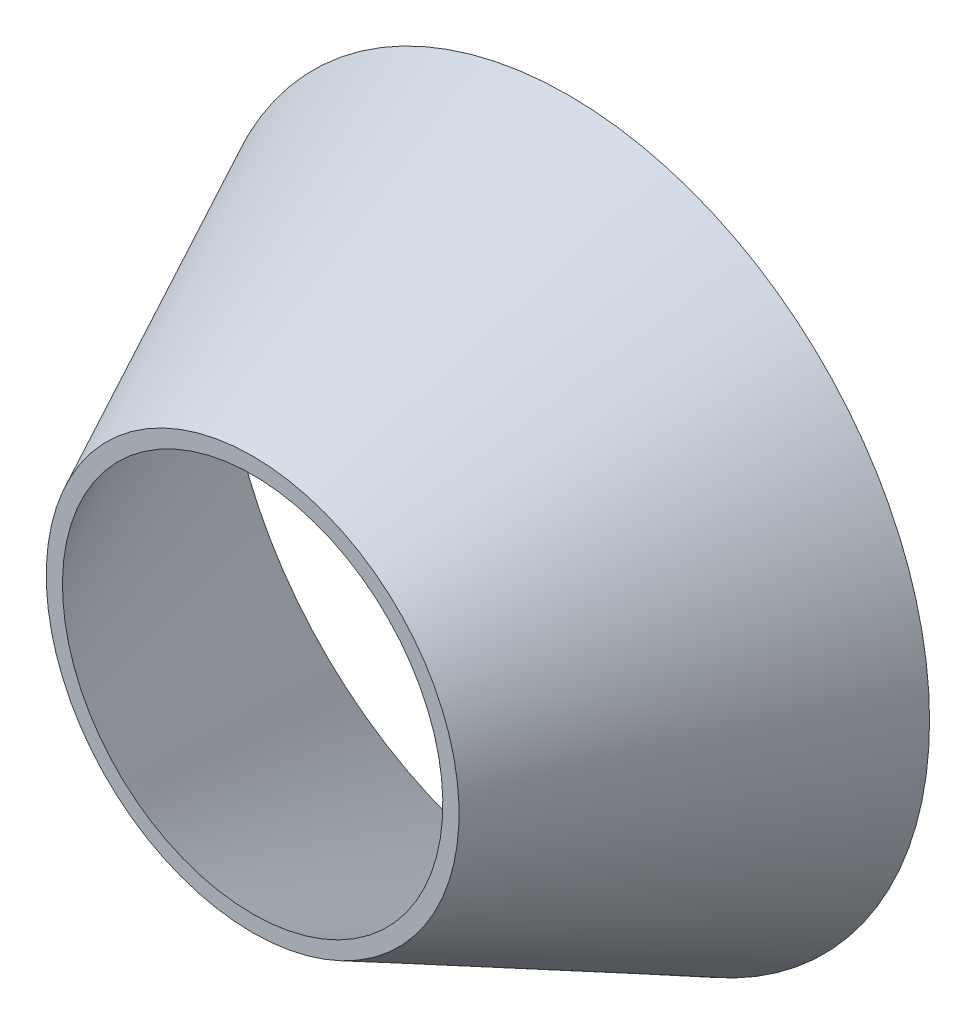
ISO-10303-21;
HEADER;
FILE_DESCRIPTION(('STEP AP214'),'2;1');
FILE_NAME('part.step','',(''),(''),'','','');
FILE_SCHEMA(('AUTOMOTIVE_DESIGN { 1 0 10303 214 1 1 1 1 }'));
ENDSEC;
DATA;
#1=APPLICATION_CONTEXT('core data for automotive mechanical design processes');
#2=APPLICATION_PROTOCOL_DEFINITION('international standard','automotive_design',2000,#1);
#3=PRODUCT_CONTEXT('',#1,'mechanical');
#4=PRODUCT('Part','Part','',(#3));
#5=PRODUCT_RELATED_PRODUCT_CATEGORY('part','',(#4));
#6=PRODUCT_DEFINITION_FORMATION('','',#4);
#7=PRODUCT_DEFINITION_CONTEXT('part definition',#1,'design');
#8=PRODUCT_DEFINITION('design','',#6,#7);
#9=PRODUCT_DEFINITION_SHAPE('','',#8);
#10=(LENGTH_UNIT() NAMED_UNIT(*) SI_UNIT(.MILLI.,.METRE.));
#11=(NAMED_UNIT(*) PLANE_ANGLE_UNIT() SI_UNIT($,.RADIAN.));
#12=(NAMED_UNIT(*) SI_UNIT($,.STERADIAN.) SOLID_ANGLE_UNIT());
#13=UNCERTAINTY_MEASURE_WITH_UNIT(LENGTH_MEASURE(1.E-05),#10,'distance_accuracy_value','');
#14=(GEOMETRIC_REPRESENTATION_CONTEXT(3) GLOBAL_UNCERTAINTY_ASSIGNED_CONTEXT((#13)) GLOBAL_UNIT_ASSIGNED_CONTEXT((#10,
#11,#12)) REPRESENTATION_CONTEXT('',''));
#15=CARTESIAN_POINT('',(0.,0.,0.));
#16=DIRECTION('',(0.,0.,1.));
#17=DIRECTION('',(1.,0.,0.));
#18=AXIS2_PLACEMENT_3D('',#15,#16,#17);
#19=CARTESIAN_POINT('',(0.,0.,-1892.51708064606));
#20=DIRECTION('',(0.,0.,-1.));
#21=DIRECTION('',(0.,1.,0.));
#22=AXIS2_PLACEMENT_3D('',#19,#20,#21);
#23=CONICAL_SURFACE('',#22,283.47969619,0.455091851568405);
#24=CARTESIAN_POINT('',(0.,0.,-2326.38914095866));
#25=DIRECTION('',(0.,0.,1.));
#26=DIRECTION('',(0.,-1.,0.));
#27=AXIS2_PLACEMENT_3D('',#24,#25,#26);
#28=CIRCLE('',#27,495.795249314038);
#29=CARTESIAN_POINT('',(0.,-495.795249314038,-2326.38914095866));
#30=VERTEX_POINT('',#29);
#31=EDGE_CURVE('E50',#30,#30,#28,.T.);
#32=ORIENTED_EDGE('',*,*,#31,.T.);
#33=EDGE_LOOP('',(#32));
#34=FACE_BOUND('',#33,.T.);
#35=CARTESIAN_POINT('',(0.,0.,-1892.51708064606));
#36=DIRECTION('',(0.,0.,1.));
#37=DIRECTION('',(0.,-1.,0.));
#38=AXIS2_PLACEMENT_3D('',#35,#36,#37);
#39=CIRCLE('',#38,283.47969619);
#40=CARTESIAN_POINT('',(0.,-283.47969619,-1892.51708064606));
#41=VERTEX_POINT('',#40);
#42=EDGE_CURVE('E10',#41,#41,#39,.T.);
#43=ORIENTED_EDGE('',*,*,#42,.F.);
#44=EDGE_LOOP('',(#43));
#45=FACE_BOUND('',#44,.T.);
#46=ADVANCED_FACE('F36',(#34,#45),#23,.T.);
#47=CARTESIAN_POINT('',(0.,0.,-1892.51708064606));
#48=DIRECTION('',(0.,0.,-1.));
#49=DIRECTION('',(0.,1.,0.));
#50=AXIS2_PLACEMENT_3D('',#47,#48,#49);
#51=PLANE('',#50);
#52=CARTESIAN_POINT('',(0.,0.,-1892.51708064606));
#53=DIRECTION('',(0.,0.,1.));
#54=DIRECTION('',(0.,-1.,0.));
#55=AXIS2_PLACEMENT_3D('',#52,#53,#54);
#56=CIRCLE('',#55,261.213452591977);
#57=CARTESIAN_POINT('',(0.,-261.213452591977,-1892.51708064606));
#58=VERTEX_POINT('',#57);
#59=EDGE_CURVE('E42',#58,#58,#56,.T.);
#60=ORIENTED_EDGE('',*,*,#59,.F.);
#61=EDGE_LOOP('',(#60));
#62=FACE_BOUND('',#61,.T.);
#63=ORIENTED_EDGE('',*,*,#42,.T.);
#64=EDGE_LOOP('',(#63));
#65=FACE_BOUND('',#64,.T.);
#66=ADVANCED_FACE('F66',(#62,#65),#51,.F.);
#67=CARTESIAN_POINT('',(0.,0.,-1892.51708064606));
#68=DIRECTION('',(0.,0.,-1.));
#69=DIRECTION('',(0.,1.,0.));
#70=AXIS2_PLACEMENT_3D('',#67,#68,#69);
#71=CONICAL_SURFACE('',#70,261.213452591977,0.455091851568406);
#72=CARTESIAN_POINT('',(0.,0.,-2326.38914095866));
#73=DIRECTION('',(0.,0.,1.));
#74=DIRECTION('',(0.,-1.,0.));
#75=AXIS2_PLACEMENT_3D('',#72,#73,#74);
#76=CIRCLE('',#75,473.529005716016);
#77=CARTESIAN_POINT('',(0.,-473.529005716016,-2326.38914095866));
#78=VERTEX_POINT('',#77);
#79=EDGE_CURVE('E46',#78,#78,#76,.T.);
#80=ORIENTED_EDGE('',*,*,#79,.F.);
#81=EDGE_LOOP('',(#80));
#82=FACE_BOUND('',#81,.T.);
#83=ORIENTED_EDGE('',*,*,#59,.T.);
#84=EDGE_LOOP('',(#83));
#85=FACE_BOUND('',#84,.T.);
#86=ADVANCED_FACE('F60',(#82,#85),#71,.F.);
#87=CARTESIAN_POINT('',(0.,0.,-2326.38914095866));
#88=DIRECTION('',(0.,0.,-1.));
#89=DIRECTION('',(0.,1.,0.));
#90=AXIS2_PLACEMENT_3D('',#87,#88,#89);
#91=PLANE('',#90);
#92=ORIENTED_EDGE('',*,*,#79,.T.);
#93=EDGE_LOOP('',(#92));
#94=FACE_BOUND('',#93,.T.);
#95=ORIENTED_EDGE('',*,*,#31,.F.);
#96=EDGE_LOOP('',(#95));
#97=FACE_BOUND('',#96,.T.);
#98=ADVANCED_FACE('F58',(#94,#97),#91,.T.);
#99=CLOSED_SHELL('',(#46,#66,#86,#98));
#100=MANIFOLD_SOLID_BREP('B2',#99);
#101=ADVANCED_BREP_SHAPE_REPRESENTATION('',(#18,#100),#14);
#102=SHAPE_DEFINITION_REPRESENTATION(#9,#101);
ENDSEC;
END-ISO-10303-21;
